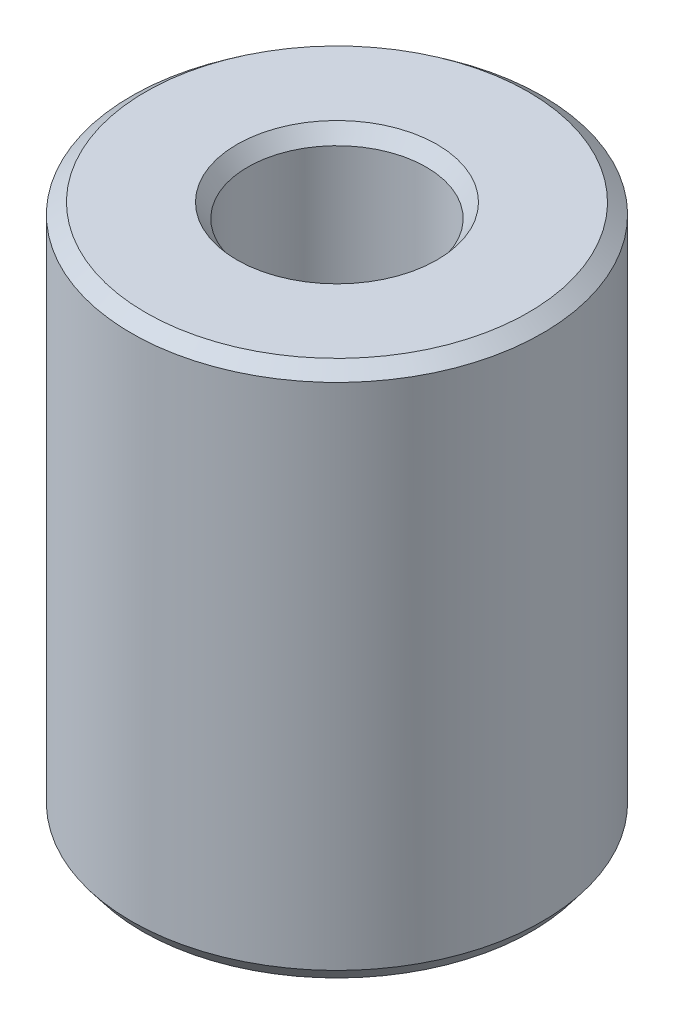
ISO-10303-21;
HEADER;
FILE_DESCRIPTION(('STEP AP214'),'2;1');
FILE_NAME('part.step','',(''),(''),'','','');
FILE_SCHEMA(('AUTOMOTIVE_DESIGN { 1 0 10303 214 1 1 1 1 }'));
ENDSEC;
DATA;
#1=APPLICATION_CONTEXT('core data for automotive mechanical design processes');
#2=APPLICATION_PROTOCOL_DEFINITION('international standard','automotive_design',2000,#1);
#3=PRODUCT_CONTEXT('',#1,'mechanical');
#4=PRODUCT('Part','Part','',(#3));
#5=PRODUCT_RELATED_PRODUCT_CATEGORY('part','',(#4));
#6=PRODUCT_DEFINITION_FORMATION('','',#4);
#7=PRODUCT_DEFINITION_CONTEXT('part definition',#1,'design');
#8=PRODUCT_DEFINITION('design','',#6,#7);
#9=PRODUCT_DEFINITION_SHAPE('','',#8);
#10=(LENGTH_UNIT() NAMED_UNIT(*) SI_UNIT(.MILLI.,.METRE.));
#11=(NAMED_UNIT(*) PLANE_ANGLE_UNIT() SI_UNIT($,.RADIAN.));
#12=(NAMED_UNIT(*) SI_UNIT($,.STERADIAN.) SOLID_ANGLE_UNIT());
#13=UNCERTAINTY_MEASURE_WITH_UNIT(LENGTH_MEASURE(1.E-05),#10,'distance_accuracy_value','');
#14=(GEOMETRIC_REPRESENTATION_CONTEXT(3) GLOBAL_UNCERTAINTY_ASSIGNED_CONTEXT((#13)) GLOBAL_UNIT_ASSIGNED_CONTEXT((#10,
#11,#12)) REPRESENTATION_CONTEXT('',''));
#15=CARTESIAN_POINT('',(0.,0.,0.));
#16=DIRECTION('',(0.,0.,1.));
#17=DIRECTION('',(1.,0.,0.));
#18=AXIS2_PLACEMENT_3D('',#15,#16,#17);
#19=CARTESIAN_POINT('',(0.,149.476880737054,0.));
#20=DIRECTION('',(0.,-1.,0.));
#21=DIRECTION('',(0.,0.,-1.));
#22=AXIS2_PLACEMENT_3D('',#19,#20,#21);
#23=CYLINDRICAL_SURFACE('',#22,57.5);
#24=CARTESIAN_POINT('',(0.,3.96944091566648,0.));
#25=DIRECTION('',(0.,1.,0.));
#26=DIRECTION('',(0.,0.,1.));
#27=AXIS2_PLACEMENT_3D('',#24,#25,#26);
#28=CIRCLE('',#27,57.5);
#29=CARTESIAN_POINT('',(0.,3.96944091566648,57.5));
#30=VERTEX_POINT('',#29);
#31=EDGE_CURVE('E10',#30,#30,#28,.T.);
#32=ORIENTED_EDGE('',*,*,#31,.T.);
#33=EDGE_LOOP('',(#32));
#34=FACE_BOUND('',#33,.T.);
#35=CARTESIAN_POINT('',(0.,146.453612312446,0.));
#36=DIRECTION('',(0.,1.,0.));
#37=DIRECTION('',(0.,0.,1.));
#38=AXIS2_PLACEMENT_3D('',#35,#36,#37);
#39=CIRCLE('',#38,57.5);
#40=CARTESIAN_POINT('',(0.,146.453612312446,-57.5));
#41=VERTEX_POINT('',#40);
#42=EDGE_CURVE('E50',#41,#41,#39,.F.);
#43=ORIENTED_EDGE('',*,*,#42,.T.);
#44=EDGE_LOOP('',(#43));
#45=FACE_BOUND('',#44,.T.);
#46=ADVANCED_FACE('F39',(#34,#45),#23,.T.);
#47=CARTESIAN_POINT('',(0.,149.476880737054,0.));
#48=DIRECTION('',(0.,1.,0.));
#49=DIRECTION('',(0.,0.,1.));
#50=AXIS2_PLACEMENT_3D('',#47,#48,#49);
#51=PLANE('',#50);
#52=CARTESIAN_POINT('',(0.,149.476880737054,0.));
#53=DIRECTION('',(0.,1.,0.));
#54=DIRECTION('',(0.,0.,1.));
#55=AXIS2_PLACEMENT_3D('',#52,#53,#54);
#56=CIRCLE('',#55,28.0000190171615);
#57=CARTESIAN_POINT('',(0.,149.476880737054,28.0000190171615));
#58=VERTEX_POINT('',#57);
#59=EDGE_CURVE('E58',#58,#58,#56,.F.);
#60=ORIENTED_EDGE('',*,*,#59,.T.);
#61=EDGE_LOOP('',(#60));
#62=FACE_BOUND('',#61,.T.);
#63=CARTESIAN_POINT('',(0.,149.476880737054,0.));
#64=DIRECTION('',(0.,1.,0.));
#65=DIRECTION('',(0.,0.,1.));
#66=AXIS2_PLACEMENT_3D('',#63,#64,#65);
#67=CIRCLE('',#66,53.5305590843335);
#68=CARTESIAN_POINT('',(0.,149.476880737054,-53.5305590843335));
#69=VERTEX_POINT('',#68);
#70=EDGE_CURVE('E61',#69,#69,#67,.T.);
#71=ORIENTED_EDGE('',*,*,#70,.T.);
#72=EDGE_LOOP('',(#71));
#73=FACE_BOUND('',#72,.T.);
#74=ADVANCED_FACE('F88',(#62,#73),#51,.T.);
#75=CARTESIAN_POINT('',(0.,0.,0.));
#76=DIRECTION('',(0.,1.,0.));
#77=DIRECTION('',(0.,0.,1.));
#78=AXIS2_PLACEMENT_3D('',#75,#76,#77);
#79=PLANE('',#78);
#80=CARTESIAN_POINT('',(0.,0.,0.));
#81=DIRECTION('',(0.,1.,0.));
#82=DIRECTION('',(0.,0.,1.));
#83=AXIS2_PLACEMENT_3D('',#80,#81,#82);
#84=CIRCLE('',#83,28.9461915082194);
#85=CARTESIAN_POINT('',(0.,0.,-28.9461915082194));
#86=VERTEX_POINT('',#85);
#87=EDGE_CURVE('E51',#86,#86,#84,.T.);
#88=ORIENTED_EDGE('',*,*,#87,.T.);
#89=EDGE_LOOP('',(#88));
#90=FACE_BOUND('',#89,.T.);
#91=CARTESIAN_POINT('',(0.,0.,0.));
#92=DIRECTION('',(0.,1.,0.));
#93=DIRECTION('',(0.,0.,1.));
#94=AXIS2_PLACEMENT_3D('',#91,#92,#93);
#95=CIRCLE('',#94,54.4767315753915);
#96=CARTESIAN_POINT('',(0.,0.,54.4767315753915));
#97=VERTEX_POINT('',#96);
#98=EDGE_CURVE('E54',#97,#97,#95,.F.);
#99=ORIENTED_EDGE('',*,*,#98,.T.);
#100=EDGE_LOOP('',(#99));
#101=FACE_BOUND('',#100,.T.);
#102=ADVANCED_FACE('F83',(#90,#101),#79,.F.);
#103=CARTESIAN_POINT('',(0.,149.476880737054,0.));
#104=DIRECTION('',(0.,-1.,0.));
#105=DIRECTION('',(0.,0.,-1.));
#106=AXIS2_PLACEMENT_3D('',#103,#104,#105);
#107=CYLINDRICAL_SURFACE('',#106,24.9767505925529);
#108=CARTESIAN_POINT('',(0.,145.507439821388,0.));
#109=DIRECTION('',(0.,1.,0.));
#110=DIRECTION('',(0.,0.,1.));
#111=AXIS2_PLACEMENT_3D('',#108,#109,#110);
#112=CIRCLE('',#111,24.9767505925529);
#113=CARTESIAN_POINT('',(0.,145.507439821388,24.9767505925529));
#114=VERTEX_POINT('',#113);
#115=EDGE_CURVE('E67',#114,#114,#112,.T.);
#116=ORIENTED_EDGE('',*,*,#115,.T.);
#117=EDGE_LOOP('',(#116));
#118=FACE_BOUND('',#117,.T.);
#119=CARTESIAN_POINT('',(0.,3.02326842460854,0.));
#120=DIRECTION('',(0.,1.,0.));
#121=DIRECTION('',(0.,0.,1.));
#122=AXIS2_PLACEMENT_3D('',#119,#120,#121);
#123=CIRCLE('',#122,24.9767505925529);
#124=CARTESIAN_POINT('',(0.,3.02326842460854,-24.9767505925529));
#125=VERTEX_POINT('',#124);
#126=EDGE_CURVE('E69',#125,#125,#123,.F.);
#127=ORIENTED_EDGE('',*,*,#126,.T.);
#128=EDGE_LOOP('',(#127));
#129=FACE_BOUND('',#128,.T.);
#130=ADVANCED_FACE('F71',(#118,#129),#107,.F.);
#131=CARTESIAN_POINT('',(0.,145.507439821388,0.));
#132=DIRECTION('',(0.,1.,0.));
#133=DIRECTION('',(0.,0.,1.));
#134=AXIS2_PLACEMENT_3D('',#131,#132,#133);
#135=CONICAL_SURFACE('',#134,24.9767505925529,0.650906542750286);
#136=ORIENTED_EDGE('',*,*,#59,.F.);
#137=EDGE_LOOP('',(#136));
#138=FACE_BOUND('',#137,.T.);
#139=ORIENTED_EDGE('',*,*,#115,.F.);
#140=EDGE_LOOP('',(#139));
#141=FACE_BOUND('',#140,.T.);
#142=ADVANCED_FACE('F77',(#138,#141),#135,.F.);
#143=CARTESIAN_POINT('',(0.,0.,0.));
#144=DIRECTION('',(0.,-1.,0.));
#145=DIRECTION('',(0.,0.,-1.));
#146=AXIS2_PLACEMENT_3D('',#143,#144,#145);
#147=CONICAL_SURFACE('',#146,28.9461915082194,0.919889784044607);
#148=CARTESIAN_POINT('',(0.,3.02326842460854,-24.9767505925529));
#149=CARTESIAN_POINT('',(0.,2.99177604518553,-25.0180989354244));
#150=CARTESIAN_POINT('',(0.,2.96028366576253,-25.0594472782959));
#151=CARTESIAN_POINT('',(0.,2.89729890691652,-25.142143964039));
#152=CARTESIAN_POINT('',(0.,2.86580652749351,-25.1834923069105));
#153=CARTESIAN_POINT('',(0.,2.8028217686475,-25.2661889926536));
#154=CARTESIAN_POINT('',(0.,2.77132938922449,-25.3075373355251));
#155=CARTESIAN_POINT('',(0.,2.70834463037848,-25.3902340212681));
#156=CARTESIAN_POINT('',(0.,2.67685225095548,-25.4315823641397));
#157=CARTESIAN_POINT('',(0.,2.61386749210947,-25.5142790498827));
#158=CARTESIAN_POINT('',(0.,2.58237511268646,-25.5556273927542));
#159=CARTESIAN_POINT('',(0.,2.51939035384045,-25.6383240784973));
#160=CARTESIAN_POINT('',(0.,2.48789797441744,-25.6796724213688));
#161=CARTESIAN_POINT('',(0.,2.42491321557143,-25.7623691071119));
#162=CARTESIAN_POINT('',(0.,2.39342083614843,-25.8037174499834));
#163=CARTESIAN_POINT('',(0.,2.33043607730241,-25.8864141357265));
#164=CARTESIAN_POINT('',(0.,2.29894369787941,-25.927762478598));
#165=CARTESIAN_POINT('',(0.,2.2359589390334,-26.010459164341));
#166=CARTESIAN_POINT('',(0.,2.20446655961039,-26.0518075072126));
#167=CARTESIAN_POINT('',(0.,2.14148180076438,-26.1345041929556));
#168=CARTESIAN_POINT('',(0.,2.10998942134138,-26.1758525358271));
#169=CARTESIAN_POINT('',(0.,2.04700466249536,-26.2585492215702));
#170=CARTESIAN_POINT('',(0.,2.01551228307236,-26.2998975644417));
#171=CARTESIAN_POINT('',(0.,1.95252752422635,-26.3825942501848));
#172=CARTESIAN_POINT('',(0.,1.92103514480334,-26.4239425930563));
#173=CARTESIAN_POINT('',(0.,1.85805038595733,-26.5066392787994));
#174=CARTESIAN_POINT('',(0.,1.82655800653433,-26.5479876216709));
#175=CARTESIAN_POINT('',(0.,1.76357324768831,-26.6306843074139));
#176=CARTESIAN_POINT('',(0.,1.73208086826531,-26.6720326502855));
#177=CARTESIAN_POINT('',(0.,1.6690961094193,-26.7547293360285));
#178=CARTESIAN_POINT('',(0.,1.63760372999629,-26.7960776789));
#179=CARTESIAN_POINT('',(0.,1.57461897115028,-26.8787743646431));
#180=CARTESIAN_POINT('',(0.,1.54312659172727,-26.9201227075146));
#181=CARTESIAN_POINT('',(0.,1.48014183288126,-27.0028193932577));
#182=CARTESIAN_POINT('',(0.,1.44864945345826,-27.0441677361292));
#183=CARTESIAN_POINT('',(0.,1.38566469461225,-27.1268644218722));
#184=CARTESIAN_POINT('',(0.,1.35417231518924,-27.1682127647438));
#185=CARTESIAN_POINT('',(0.,1.29118755634323,-27.2509094504868));
#186=CARTESIAN_POINT('',(0.,1.25969517692022,-27.2922577933583));
#187=CARTESIAN_POINT('',(0.,1.19671041807421,-27.3749544791014));
#188=CARTESIAN_POINT('',(0.,1.16521803865121,-27.4163028219729));
#189=CARTESIAN_POINT('',(0.,1.1022332798052,-27.498999507716));
#190=CARTESIAN_POINT('',(0.,1.07074090038219,-27.5403478505875));
#191=CARTESIAN_POINT('',(0.,1.00775614153618,-27.6230445363306));
#192=CARTESIAN_POINT('',(0.,0.976263762113174,-27.6643928792021));
#193=CARTESIAN_POINT('',(0.,0.913279003267162,-27.7470895649451));
#194=CARTESIAN_POINT('',(0.,0.881786623844157,-27.7884379078167));
#195=CARTESIAN_POINT('',(0.,0.818801864998146,-27.8711345935597));
#196=CARTESIAN_POINT('',(0.,0.78730948557514,-27.9124829364312));
#197=CARTESIAN_POINT('',(0.,0.724324726729129,-27.9951796221743));
#198=CARTESIAN_POINT('',(0.,0.692832347306123,-28.0365279650458));
#199=CARTESIAN_POINT('',(0.,0.629847588460112,-28.1192246507889));
#200=CARTESIAN_POINT('',(0.,0.598355209037106,-28.1605729936604));
#201=CARTESIAN_POINT('',(0.,0.535370450191095,-28.2432696794034));
#202=CARTESIAN_POINT('',(0.,0.50387807076809,-28.284618022275));
#203=CARTESIAN_POINT('',(0.,0.440893311922078,-28.367314708018));
#204=CARTESIAN_POINT('',(0.,0.409400932499073,-28.4086630508896));
#205=CARTESIAN_POINT('',(0.,0.346416173653062,-28.4913597366326));
#206=CARTESIAN_POINT('',(0.,0.314923794230056,-28.5327080795041));
#207=CARTESIAN_POINT('',(0.,0.251939035384045,-28.6154047652472));
#208=CARTESIAN_POINT('',(0.,0.220446655961039,-28.6567531081187));
#209=CARTESIAN_POINT('',(0.,0.157461897115028,-28.7394497938618));
#210=CARTESIAN_POINT('',(0.,0.125969517692022,-28.7807981367333));
#211=CARTESIAN_POINT('',(0.,0.0629847588460114,-28.8634948224763));
#212=CARTESIAN_POINT('',(0.,0.031492379423006,-28.9048431653479));
#213=CARTESIAN_POINT('',(0.,0.,-28.9461915082194));
#214=B_SPLINE_CURVE_WITH_KNOTS('',3,(#148,#149,#150,#151,#152,#153,#154,#155,#156,#157,#158,
#159,#160,#161,#162,#163,#164,#165,#166,#167,#168,#169,#170,#171,#172,#173,#174,#175,#176,#177,
#178,#179,#180,#181,#182,#183,#184,#185,#186,#187,#188,#189,#190,#191,#192,#193,#194,#195,#196,
#197,#198,#199,#200,#201,#202,#203,#204,#205,#206,#207,#208,#209,#210,#211,#212,#213),
.UNSPECIFIED.,.F.,.F.,(4,2,2,2,2,2,2,2,2,2,2,2,2,2,2,2,2,2,2,2,2,2,2,2,2,2,2,2,2,2,2,2,4),(0.,
0.155926581375642,0.311853162751284,0.467779744126923,0.623706325502565,0.779632906878207,
0.935559488253849,1.09148606962949,1.24741265100513,1.40333923238077,1.55926581375641,
1.71519239513206,1.8711189765077,2.02704555788334,2.18297213925898,2.33889872063462,
2.49482530201026,2.6507518833859,2.80667846476155,2.96260504613719,3.11853162751283,
3.27445820888847,3.43038479026411,3.58631137163975,3.74223795301539,3.89816453439103,
4.05409111576668,4.21001769714232,4.36594427851796,4.5218708598936,4.67779744126924,
4.83372402264488,4.98965060402052),.UNSPECIFIED.);
#215=EDGE_CURVE('BSEAM73',#125,#86,#214,.T.);
#216=ORIENTED_EDGE('',*,*,#126,.F.);
#217=ORIENTED_EDGE('',*,*,#87,.F.);
#218=ORIENTED_EDGE('',*,*,#215,.T.);
#219=ORIENTED_EDGE('',*,*,#215,.F.);
#220=EDGE_LOOP('',(#216,#218,#217,#219));
#221=FACE_BOUND('',#220,.T.);
#222=ADVANCED_FACE('F73',(#221),#147,.F.);
#223=CARTESIAN_POINT('',(0.,3.96944091566648,0.));
#224=DIRECTION('',(0.,1.,0.));
#225=DIRECTION('',(0.,0.,1.));
#226=AXIS2_PLACEMENT_3D('',#223,#224,#225);
#227=CONICAL_SURFACE('',#226,57.5,0.650906542750291);
#228=ORIENTED_EDGE('',*,*,#98,.F.);
#229=EDGE_LOOP('',(#228));
#230=FACE_BOUND('',#229,.T.);
#231=ORIENTED_EDGE('',*,*,#31,.F.);
#232=EDGE_LOOP('',(#231));
#233=FACE_BOUND('',#232,.T.);
#234=ADVANCED_FACE('F76',(#230,#233),#227,.T.);
#235=CARTESIAN_POINT('',(0.,149.476880737054,0.));
#236=DIRECTION('',(0.,-1.,0.));
#237=DIRECTION('',(0.,0.,-1.));
#238=AXIS2_PLACEMENT_3D('',#235,#236,#237);
#239=CONICAL_SURFACE('',#238,53.5305590843335,0.919889784044602);
#240=CARTESIAN_POINT('',(0.,146.453612312446,-57.5));
#241=CARTESIAN_POINT('',(0.,146.485104691869,-57.4586516571285));
#242=CARTESIAN_POINT('',(0.,146.516597071292,-57.417303314257));
#243=CARTESIAN_POINT('',(0.,146.579581830138,-57.3346066285139));
#244=CARTESIAN_POINT('',(0.,146.611074209561,-57.2932582856424));
#245=CARTESIAN_POINT('',(0.,146.674058968407,-57.2105615998993));
#246=CARTESIAN_POINT('',(0.,146.70555134783,-57.1692132570278));
#247=CARTESIAN_POINT('',(0.,146.768536106676,-57.0865165712848));
#248=CARTESIAN_POINT('',(0.,146.800028486099,-57.0451682284132));
#249=CARTESIAN_POINT('',(0.,146.863013244945,-56.9624715426702));
#250=CARTESIAN_POINT('',(0.,146.894505624368,-56.9211231997987));
#251=CARTESIAN_POINT('',(0.,146.957490383214,-56.8384265140556));
#252=CARTESIAN_POINT('',(0.,146.988982762637,-56.7970781711841));
#253=CARTESIAN_POINT('',(0.,147.051967521483,-56.714381485441));
#254=CARTESIAN_POINT('',(0.,147.083459900906,-56.6730331425695));
#255=CARTESIAN_POINT('',(0.,147.146444659752,-56.5903364568264));
#256=CARTESIAN_POINT('',(0.,147.177937039175,-56.5489881139549));
#257=CARTESIAN_POINT('',(0.,147.240921798021,-56.4662914282119));
#258=CARTESIAN_POINT('',(0.,147.272414177444,-56.4249430853403));
#259=CARTESIAN_POINT('',(0.,147.33539893629,-56.3422463995973));
#260=CARTESIAN_POINT('',(0.,147.366891315713,-56.3008980567257));
#261=CARTESIAN_POINT('',(0.,147.429876074559,-56.2182013709827));
#262=CARTESIAN_POINT('',(0.,147.461368453982,-56.1768530281112));
#263=CARTESIAN_POINT('',(0.,147.524353212828,-56.0941563423681));
#264=CARTESIAN_POINT('',(0.,147.555845592251,-56.0528079994966));
#265=CARTESIAN_POINT('',(0.,147.618830351097,-55.9701113137535));
#266=CARTESIAN_POINT('',(0.,147.65032273052,-55.928762970882));
#267=CARTESIAN_POINT('',(0.,147.713307489366,-55.846066285139));
#268=CARTESIAN_POINT('',(0.,147.744799868789,-55.8047179422674));
#269=CARTESIAN_POINT('',(0.,147.807784627635,-55.7220212565244));
#270=CARTESIAN_POINT('',(0.,147.839277007058,-55.6806729136529));
#271=CARTESIAN_POINT('',(0.,147.902261765904,-55.5979762279098));
#272=CARTESIAN_POINT('',(0.,147.933754145327,-55.5566278850383));
#273=CARTESIAN_POINT('',(0.,147.996738904173,-55.4739311992952));
#274=CARTESIAN_POINT('',(0.,148.028231283596,-55.4325828564237));
#275=CARTESIAN_POINT('',(0.,148.091216042442,-55.3498861706806));
#276=CARTESIAN_POINT('',(0.,148.122708421865,-55.3085378278091));
#277=CARTESIAN_POINT('',(0.,148.185693180711,-55.2258411420661));
#278=CARTESIAN_POINT('',(0.,148.217185560134,-55.1844927991945));
#279=CARTESIAN_POINT('',(0.,148.28017031898,-55.1017961134515));
#280=CARTESIAN_POINT('',(0.,148.311662698403,-55.06044777058));
#281=CARTESIAN_POINT('',(0.,148.374647457249,-54.9777510848369));
#282=CARTESIAN_POINT('',(0.,148.406139836672,-54.9364027419654));
#283=CARTESIAN_POINT('',(0.,148.469124595518,-54.8537060562223));
#284=CARTESIAN_POINT('',(0.,148.500616974941,-54.8123577133508));
#285=CARTESIAN_POINT('',(0.,148.563601733787,-54.7296610276077));
#286=CARTESIAN_POINT('',(0.,148.59509411321,-54.6883126847362));
#287=CARTESIAN_POINT('',(0.,148.658078872056,-54.6056159989932));
#288=CARTESIAN_POINT('',(0.,148.689571251479,-54.5642676561216));
#289=CARTESIAN_POINT('',(0.,148.752556010325,-54.4815709703786));
#290=CARTESIAN_POINT('',(0.,148.784048389748,-54.4402226275071));
#291=CARTESIAN_POINT('',(0.,148.847033148594,-54.357525941764));
#292=CARTESIAN_POINT('',(0.,148.878525528017,-54.3161775988925));
#293=CARTESIAN_POINT('',(0.,148.941510286863,-54.2334809131494));
#294=CARTESIAN_POINT('',(0.,148.973002666286,-54.1921325702779));
#295=CARTESIAN_POINT('',(0.,149.035987425132,-54.1094358845348));
#296=CARTESIAN_POINT('',(0.,149.067479804555,-54.0680875416633));
#297=CARTESIAN_POINT('',(0.,149.130464563401,-53.9853908559203));
#298=CARTESIAN_POINT('',(0.,149.161956942824,-53.9440425130487));
#299=CARTESIAN_POINT('',(0.,149.22494170167,-53.8613458273057));
#300=CARTESIAN_POINT('',(0.,149.256434081093,-53.8199974844342));
#301=CARTESIAN_POINT('',(0.,149.319418839939,-53.7373007986911));
#302=CARTESIAN_POINT('',(0.,149.350911219362,-53.6959524558196));
#303=CARTESIAN_POINT('',(0.,149.413895978208,-53.6132557700765));
#304=CARTESIAN_POINT('',(0.,149.445388357631,-53.571907427205));
#305=CARTESIAN_POINT('',(0.,149.476880737054,-53.5305590843335));
#306=B_SPLINE_CURVE_WITH_KNOTS('',3,(#240,#241,#242,#243,#244,#245,#246,#247,#248,#249,#250,
#251,#252,#253,#254,#255,#256,#257,#258,#259,#260,#261,#262,#263,#264,#265,#266,#267,#268,#269,
#270,#271,#272,#273,#274,#275,#276,#277,#278,#279,#280,#281,#282,#283,#284,#285,#286,#287,#288,
#289,#290,#291,#292,#293,#294,#295,#296,#297,#298,#299,#300,#301,#302,#303,#304,#305),
.UNSPECIFIED.,.F.,.F.,(4,2,2,2,2,2,2,2,2,2,2,2,2,2,2,2,2,2,2,2,2,2,2,2,2,2,2,2,2,2,2,2,4),(0.,
0.155926581375659,0.311853162751301,0.467779744126943,0.623706325502585,0.779632906878232,
0.935559488253874,1.09148606962952,1.24741265100516,1.4033392323808,1.55926581375644,
1.71519239513208,1.87111897650773,2.02704555788337,2.18297213925901,2.33889872063465,
2.49482530201029,2.65075188338595,2.80667846476159,2.96260504613724,3.11853162751288,
3.27445820888852,3.43038479026417,3.58631137163981,3.74223795301545,3.89816453439109,
4.05409111576673,4.21001769714238,4.36594427851802,4.52187085989366,4.6777974412693,
4.83372402264494,4.9896506040206),.UNSPECIFIED.);
#307=EDGE_CURVE('BSEAM45',#41,#69,#306,.T.);
#308=ORIENTED_EDGE('',*,*,#42,.F.);
#309=ORIENTED_EDGE('',*,*,#70,.F.);
#310=ORIENTED_EDGE('',*,*,#307,.T.);
#311=ORIENTED_EDGE('',*,*,#307,.F.);
#312=EDGE_LOOP('',(#308,#310,#309,#311));
#313=FACE_BOUND('',#312,.T.);
#314=ADVANCED_FACE('F45',(#313),#239,.T.);
#315=CLOSED_SHELL('',(#46,#74,#102,#130,#142,#222,#234,#314));
#316=MANIFOLD_SOLID_BREP('B2',#315);
#317=ADVANCED_BREP_SHAPE_REPRESENTATION('',(#18,#316),#14);
#318=SHAPE_DEFINITION_REPRESENTATION(#9,#317);
ENDSEC;
END-ISO-10303-21;
